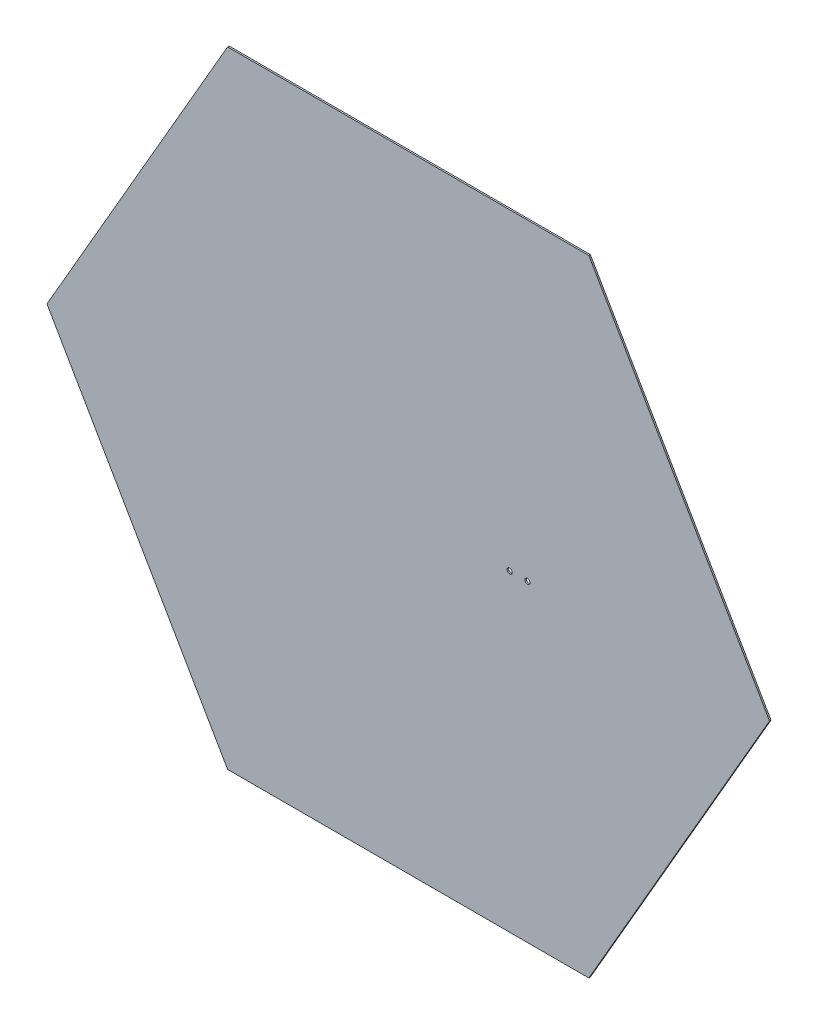
ISO-10303-21;
HEADER;
FILE_DESCRIPTION(('STEP AP214'),'2;1');
FILE_NAME('part.step','',(''),(''),'','','');
FILE_SCHEMA(('AUTOMOTIVE_DESIGN { 1 0 10303 214 1 1 1 1 }'));
ENDSEC;
DATA;
#1=APPLICATION_CONTEXT('core data for automotive mechanical design processes');
#2=APPLICATION_PROTOCOL_DEFINITION('international standard','automotive_design',2000,#1);
#3=PRODUCT_CONTEXT('',#1,'mechanical');
#4=PRODUCT('Part','Part','',(#3));
#5=PRODUCT_RELATED_PRODUCT_CATEGORY('part','',(#4));
#6=PRODUCT_DEFINITION_FORMATION('','',#4);
#7=PRODUCT_DEFINITION_CONTEXT('part definition',#1,'design');
#8=PRODUCT_DEFINITION('design','',#6,#7);
#9=PRODUCT_DEFINITION_SHAPE('','',#8);
#10=(LENGTH_UNIT() NAMED_UNIT(*) SI_UNIT(.MILLI.,.METRE.));
#11=(NAMED_UNIT(*) PLANE_ANGLE_UNIT() SI_UNIT($,.RADIAN.));
#12=(NAMED_UNIT(*) SI_UNIT($,.STERADIAN.) SOLID_ANGLE_UNIT());
#13=UNCERTAINTY_MEASURE_WITH_UNIT(LENGTH_MEASURE(1.E-05),#10,'distance_accuracy_value','');
#14=(GEOMETRIC_REPRESENTATION_CONTEXT(3) GLOBAL_UNCERTAINTY_ASSIGNED_CONTEXT((#13)) GLOBAL_UNIT_ASSIGNED_CONTEXT((#10,
#11,#12)) REPRESENTATION_CONTEXT('',''));
#15=CARTESIAN_POINT('',(0.,0.,0.));
#16=DIRECTION('',(0.,0.,1.));
#17=DIRECTION('',(1.,0.,0.));
#18=AXIS2_PLACEMENT_3D('',#15,#16,#17);
#19=CARTESIAN_POINT('',(388.787671272294,0.,1.65));
#20=DIRECTION('',(-0.866025403784438,-0.5,0.));
#21=DIRECTION('',(0.5,-0.866025403784439,0.));
#22=AXIS2_PLACEMENT_3D('',#19,#20,#21);
#23=PLANE('',#22);
#24=DIRECTION('',(-0.5,0.866025403784438,0.));
#25=VECTOR('',#24,1.);
#26=CARTESIAN_POINT('',(388.787671272294,0.,0.));
#27=LINE('',#26,#25);
#28=CARTESIAN_POINT('',(388.787671272294,0.,0.));
#29=VERTEX_POINT('',#28);
#30=CARTESIAN_POINT('',(194.393835636147,336.7,0.));
#31=VERTEX_POINT('',#30);
#32=EDGE_CURVE('E117',#29,#31,#27,.T.);
#33=ORIENTED_EDGE('',*,*,#32,.T.);
#34=DIRECTION('',(0.,0.,-1.));
#35=VECTOR('',#34,1.);
#36=CARTESIAN_POINT('',(194.393835636147,336.7,1.65));
#37=LINE('',#36,#35);
#38=CARTESIAN_POINT('',(194.393835636147,336.7,1.65));
#39=VERTEX_POINT('',#38);
#40=EDGE_CURVE('E11',#39,#31,#37,.T.);
#41=ORIENTED_EDGE('',*,*,#40,.F.);
#42=DIRECTION('',(-0.5,0.866025403784438,0.));
#43=VECTOR('',#42,1.);
#44=CARTESIAN_POINT('',(388.787671272294,0.,1.65));
#45=LINE('',#44,#43);
#46=CARTESIAN_POINT('',(388.787671272294,0.,1.65));
#47=VERTEX_POINT('',#46);
#48=EDGE_CURVE('E128',#47,#39,#45,.T.);
#49=ORIENTED_EDGE('',*,*,#48,.F.);
#50=DIRECTION('',(0.,0.,-1.));
#51=VECTOR('',#50,1.);
#52=CARTESIAN_POINT('',(388.787671272294,0.,1.65));
#53=LINE('',#52,#51);
#54=EDGE_CURVE('E113',#47,#29,#53,.T.);
#55=ORIENTED_EDGE('',*,*,#54,.T.);
#56=EDGE_LOOP('',(#33,#41,#49,#55));
#57=FACE_BOUND('',#56,.T.);
#58=ADVANCED_FACE('F33',(#57),#23,.F.);
#59=CARTESIAN_POINT('',(194.393835636147,336.7,1.65));
#60=DIRECTION('',(0.,-1.,0.));
#61=DIRECTION('',(1.,0.,0.));
#62=AXIS2_PLACEMENT_3D('',#59,#60,#61);
#63=PLANE('',#62);
#64=DIRECTION('',(-1.,0.,0.));
#65=VECTOR('',#64,1.);
#66=CARTESIAN_POINT('',(194.393835636147,336.7,0.));
#67=LINE('',#66,#65);
#68=CARTESIAN_POINT('',(-194.393835636147,336.7,0.));
#69=VERTEX_POINT('',#68);
#70=EDGE_CURVE('E120',#31,#69,#67,.T.);
#71=ORIENTED_EDGE('',*,*,#70,.T.);
#72=DIRECTION('',(0.,0.,-1.));
#73=VECTOR('',#72,1.);
#74=CARTESIAN_POINT('',(-194.393835636147,336.7,1.65));
#75=LINE('',#74,#73);
#76=CARTESIAN_POINT('',(-194.393835636147,336.7,1.65));
#77=VERTEX_POINT('',#76);
#78=EDGE_CURVE('E41',#77,#69,#75,.T.);
#79=ORIENTED_EDGE('',*,*,#78,.F.);
#80=DIRECTION('',(-1.,0.,0.));
#81=VECTOR('',#80,1.);
#82=CARTESIAN_POINT('',(194.393835636147,336.7,1.65));
#83=LINE('',#82,#81);
#84=EDGE_CURVE('E86',#39,#77,#83,.T.);
#85=ORIENTED_EDGE('',*,*,#84,.F.);
#86=ORIENTED_EDGE('',*,*,#40,.T.);
#87=EDGE_LOOP('',(#71,#79,#85,#86));
#88=FACE_BOUND('',#87,.T.);
#89=ADVANCED_FACE('F153',(#88),#63,.F.);
#90=CARTESIAN_POINT('',(-194.393835636147,336.7,1.65));
#91=DIRECTION('',(0.866025403784439,-0.5,0.));
#92=DIRECTION('',(0.5,0.866025403784439,0.));
#93=AXIS2_PLACEMENT_3D('',#90,#91,#92);
#94=PLANE('',#93);
#95=DIRECTION('',(-0.5,-0.866025403784439,0.));
#96=VECTOR('',#95,1.);
#97=CARTESIAN_POINT('',(-194.393835636147,336.7,0.));
#98=LINE('',#97,#96);
#99=CARTESIAN_POINT('',(-388.787671272294,0.,0.));
#100=VERTEX_POINT('',#99);
#101=EDGE_CURVE('E123',#69,#100,#98,.T.);
#102=ORIENTED_EDGE('',*,*,#101,.T.);
#103=DIRECTION('',(0.,0.,-1.));
#104=VECTOR('',#103,1.);
#105=CARTESIAN_POINT('',(-388.787671272294,0.,1.65));
#106=LINE('',#105,#104);
#107=CARTESIAN_POINT('',(-388.787671272294,0.,1.65));
#108=VERTEX_POINT('',#107);
#109=EDGE_CURVE('E108',#108,#100,#106,.T.);
#110=ORIENTED_EDGE('',*,*,#109,.F.);
#111=DIRECTION('',(-0.5,-0.866025403784439,0.));
#112=VECTOR('',#111,1.);
#113=CARTESIAN_POINT('',(-194.393835636147,336.7,1.65));
#114=LINE('',#113,#112);
#115=EDGE_CURVE('E99',#77,#108,#114,.T.);
#116=ORIENTED_EDGE('',*,*,#115,.F.);
#117=ORIENTED_EDGE('',*,*,#78,.T.);
#118=EDGE_LOOP('',(#102,#110,#116,#117));
#119=FACE_BOUND('',#118,.T.);
#120=ADVANCED_FACE('F134',(#119),#94,.F.);
#121=CARTESIAN_POINT('',(-388.787671272294,0.,1.65));
#122=DIRECTION('',(0.866025403784439,0.5,0.));
#123=DIRECTION('',(-0.5,0.866025403784439,0.));
#124=AXIS2_PLACEMENT_3D('',#121,#122,#123);
#125=PLANE('',#124);
#126=DIRECTION('',(0.5,-0.866025403784439,0.));
#127=VECTOR('',#126,1.);
#128=CARTESIAN_POINT('',(-388.787671272294,0.,0.));
#129=LINE('',#128,#127);
#130=CARTESIAN_POINT('',(-194.393835636147,-336.7,0.));
#131=VERTEX_POINT('',#130);
#132=EDGE_CURVE('E107',#100,#131,#129,.T.);
#133=ORIENTED_EDGE('',*,*,#132,.T.);
#134=DIRECTION('',(0.,0.,-1.));
#135=VECTOR('',#134,1.);
#136=CARTESIAN_POINT('',(-194.393835636147,-336.7,1.65));
#137=LINE('',#136,#135);
#138=CARTESIAN_POINT('',(-194.393835636147,-336.7,1.65));
#139=VERTEX_POINT('',#138);
#140=EDGE_CURVE('E104',#139,#131,#137,.T.);
#141=ORIENTED_EDGE('',*,*,#140,.F.);
#142=DIRECTION('',(0.5,-0.866025403784439,0.));
#143=VECTOR('',#142,1.);
#144=CARTESIAN_POINT('',(-388.787671272294,0.,1.65));
#145=LINE('',#144,#143);
#146=EDGE_CURVE('E93',#108,#139,#145,.T.);
#147=ORIENTED_EDGE('',*,*,#146,.F.);
#148=ORIENTED_EDGE('',*,*,#109,.T.);
#149=EDGE_LOOP('',(#133,#141,#147,#148));
#150=FACE_BOUND('',#149,.T.);
#151=ADVANCED_FACE('F105',(#150),#125,.F.);
#152=CARTESIAN_POINT('',(-194.393835636147,-336.7,1.65));
#153=DIRECTION('',(0.,1.,0.));
#154=DIRECTION('',(0.,0.,1.));
#155=AXIS2_PLACEMENT_3D('',#152,#153,#154);
#156=PLANE('',#155);
#157=DIRECTION('',(1.,0.,0.));
#158=VECTOR('',#157,1.);
#159=CARTESIAN_POINT('',(-194.393835636147,-336.7,0.));
#160=LINE('',#159,#158);
#161=CARTESIAN_POINT('',(194.393835636147,-336.7,0.));
#162=VERTEX_POINT('',#161);
#163=EDGE_CURVE('E72',#131,#162,#160,.T.);
#164=ORIENTED_EDGE('',*,*,#163,.T.);
#165=DIRECTION('',(0.,0.,-1.));
#166=VECTOR('',#165,1.);
#167=CARTESIAN_POINT('',(194.393835636147,-336.7,1.65));
#168=LINE('',#167,#166);
#169=CARTESIAN_POINT('',(194.393835636147,-336.7,1.65));
#170=VERTEX_POINT('',#169);
#171=EDGE_CURVE('E109',#170,#162,#168,.T.);
#172=ORIENTED_EDGE('',*,*,#171,.F.);
#173=DIRECTION('',(1.,0.,0.));
#174=VECTOR('',#173,1.);
#175=CARTESIAN_POINT('',(-194.393835636147,-336.7,1.65));
#176=LINE('',#175,#174);
#177=EDGE_CURVE('E97',#139,#170,#176,.T.);
#178=ORIENTED_EDGE('',*,*,#177,.F.);
#179=ORIENTED_EDGE('',*,*,#140,.T.);
#180=EDGE_LOOP('',(#164,#172,#178,#179));
#181=FACE_BOUND('',#180,.T.);
#182=ADVANCED_FACE('F111',(#181),#156,.F.);
#183=CARTESIAN_POINT('',(194.393835636147,-336.7,1.65));
#184=DIRECTION('',(-0.866025403784439,0.5,0.));
#185=DIRECTION('',(-0.5,-0.866025403784439,0.));
#186=AXIS2_PLACEMENT_3D('',#183,#184,#185);
#187=PLANE('',#186);
#188=DIRECTION('',(0.5,0.866025403784439,0.));
#189=VECTOR('',#188,1.);
#190=CARTESIAN_POINT('',(194.393835636147,-336.7,0.));
#191=LINE('',#190,#189);
#192=EDGE_CURVE('E78',#162,#29,#191,.T.);
#193=ORIENTED_EDGE('',*,*,#192,.T.);
#194=ORIENTED_EDGE('',*,*,#54,.F.);
#195=DIRECTION('',(0.5,0.866025403784439,0.));
#196=VECTOR('',#195,1.);
#197=CARTESIAN_POINT('',(194.393835636147,-336.7,1.65));
#198=LINE('',#197,#196);
#199=EDGE_CURVE('E49',#170,#47,#198,.T.);
#200=ORIENTED_EDGE('',*,*,#199,.F.);
#201=ORIENTED_EDGE('',*,*,#171,.T.);
#202=EDGE_LOOP('',(#193,#194,#200,#201));
#203=FACE_BOUND('',#202,.T.);
#204=ADVANCED_FACE('F141',(#203),#187,.F.);
#205=CARTESIAN_POINT('',(0.,0.,1.65));
#206=DIRECTION('',(0.,0.,1.));
#207=DIRECTION('',(1.,0.,0.));
#208=AXIS2_PLACEMENT_3D('',#205,#206,#207);
#209=PLANE('',#208);
#210=CARTESIAN_POINT('',(128.25,0.,1.65));
#211=DIRECTION('',(0.,0.,-1.));
#212=DIRECTION('',(-1.,0.,0.));
#213=AXIS2_PLACEMENT_3D('',#210,#211,#212);
#214=CIRCLE('',#213,2.75000000000001);
#215=CARTESIAN_POINT('',(125.5,0.,1.65));
#216=VERTEX_POINT('',#215);
#217=EDGE_CURVE('E121',#216,#216,#214,.T.);
#218=ORIENTED_EDGE('',*,*,#217,.T.);
#219=EDGE_LOOP('',(#218));
#220=FACE_BOUND('',#219,.T.);
#221=CARTESIAN_POINT('',(109.15,0.,1.65));
#222=DIRECTION('',(0.,0.,-1.));
#223=DIRECTION('',(-1.,0.,0.));
#224=AXIS2_PLACEMENT_3D('',#221,#222,#223);
#225=CIRCLE('',#224,2.75000000000001);
#226=CARTESIAN_POINT('',(106.4,0.,1.65));
#227=VERTEX_POINT('',#226);
#228=EDGE_CURVE('E219',#227,#227,#225,.T.);
#229=ORIENTED_EDGE('',*,*,#228,.T.);
#230=EDGE_LOOP('',(#229));
#231=FACE_BOUND('',#230,.T.);
#232=ORIENTED_EDGE('',*,*,#48,.T.);
#233=ORIENTED_EDGE('',*,*,#84,.T.);
#234=ORIENTED_EDGE('',*,*,#115,.T.);
#235=ORIENTED_EDGE('',*,*,#146,.T.);
#236=ORIENTED_EDGE('',*,*,#177,.T.);
#237=ORIENTED_EDGE('',*,*,#199,.T.);
#238=EDGE_LOOP('',(#232,#233,#234,#235,#236,#237));
#239=FACE_BOUND('',#238,.T.);
#240=ADVANCED_FACE('F95',(#220,#231,#239),#209,.T.);
#241=CARTESIAN_POINT('',(0.,0.,0.));
#242=DIRECTION('',(0.,0.,1.));
#243=DIRECTION('',(1.,0.,0.));
#244=AXIS2_PLACEMENT_3D('',#241,#242,#243);
#245=PLANE('',#244);
#246=CARTESIAN_POINT('',(128.25,0.,0.));
#247=DIRECTION('',(0.,0.,-1.));
#248=DIRECTION('',(-1.,0.,0.));
#249=AXIS2_PLACEMENT_3D('',#246,#247,#248);
#250=CIRCLE('',#249,2.75000000000001);
#251=CARTESIAN_POINT('',(125.5,0.,0.));
#252=VERTEX_POINT('',#251);
#253=EDGE_CURVE('E218',#252,#252,#250,.T.);
#254=ORIENTED_EDGE('',*,*,#253,.F.);
#255=EDGE_LOOP('',(#254));
#256=FACE_BOUND('',#255,.T.);
#257=CARTESIAN_POINT('',(109.15,0.,0.));
#258=DIRECTION('',(0.,0.,-1.));
#259=DIRECTION('',(-1.,0.,0.));
#260=AXIS2_PLACEMENT_3D('',#257,#258,#259);
#261=CIRCLE('',#260,2.75000000000001);
#262=CARTESIAN_POINT('',(106.4,0.,0.));
#263=VERTEX_POINT('',#262);
#264=EDGE_CURVE('E223',#263,#263,#261,.T.);
#265=ORIENTED_EDGE('',*,*,#264,.F.);
#266=EDGE_LOOP('',(#265));
#267=FACE_BOUND('',#266,.T.);
#268=ORIENTED_EDGE('',*,*,#32,.F.);
#269=ORIENTED_EDGE('',*,*,#192,.F.);
#270=ORIENTED_EDGE('',*,*,#163,.F.);
#271=ORIENTED_EDGE('',*,*,#132,.F.);
#272=ORIENTED_EDGE('',*,*,#101,.F.);
#273=ORIENTED_EDGE('',*,*,#70,.F.);
#274=EDGE_LOOP('',(#268,#269,#270,#271,#272,#273));
#275=FACE_BOUND('',#274,.T.);
#276=ADVANCED_FACE('F137',(#256,#267,#275),#245,.F.);
#277=CARTESIAN_POINT('',(109.15,0.,1.65));
#278=DIRECTION('',(0.,0.,-1.));
#279=DIRECTION('',(-1.,0.,0.));
#280=AXIS2_PLACEMENT_3D('',#277,#278,#279);
#281=CYLINDRICAL_SURFACE('',#280,2.75000000000001);
#282=ORIENTED_EDGE('',*,*,#228,.F.);
#283=EDGE_LOOP('',(#282));
#284=FACE_BOUND('',#283,.T.);
#285=ORIENTED_EDGE('',*,*,#264,.T.);
#286=EDGE_LOOP('',(#285));
#287=FACE_BOUND('',#286,.T.);
#288=ADVANCED_FACE('F190',(#284,#287),#281,.F.);
#289=CARTESIAN_POINT('',(128.25,0.,1.65));
#290=DIRECTION('',(0.,0.,-1.));
#291=DIRECTION('',(-1.,0.,0.));
#292=AXIS2_PLACEMENT_3D('',#289,#290,#291);
#293=CYLINDRICAL_SURFACE('',#292,2.75000000000001);
#294=ORIENTED_EDGE('',*,*,#217,.F.);
#295=EDGE_LOOP('',(#294));
#296=FACE_BOUND('',#295,.T.);
#297=ORIENTED_EDGE('',*,*,#253,.T.);
#298=EDGE_LOOP('',(#297));
#299=FACE_BOUND('',#298,.T.);
#300=ADVANCED_FACE('F199',(#296,#299),#293,.F.);
#301=CLOSED_SHELL('',(#58,#89,#120,#151,#182,#204,#240,#276,#288,#300));
#302=MANIFOLD_SOLID_BREP('B2',#301);
#303=ADVANCED_BREP_SHAPE_REPRESENTATION('',(#18,#302),#14);
#304=SHAPE_DEFINITION_REPRESENTATION(#9,#303);
ENDSEC;
END-ISO-10303-21;
